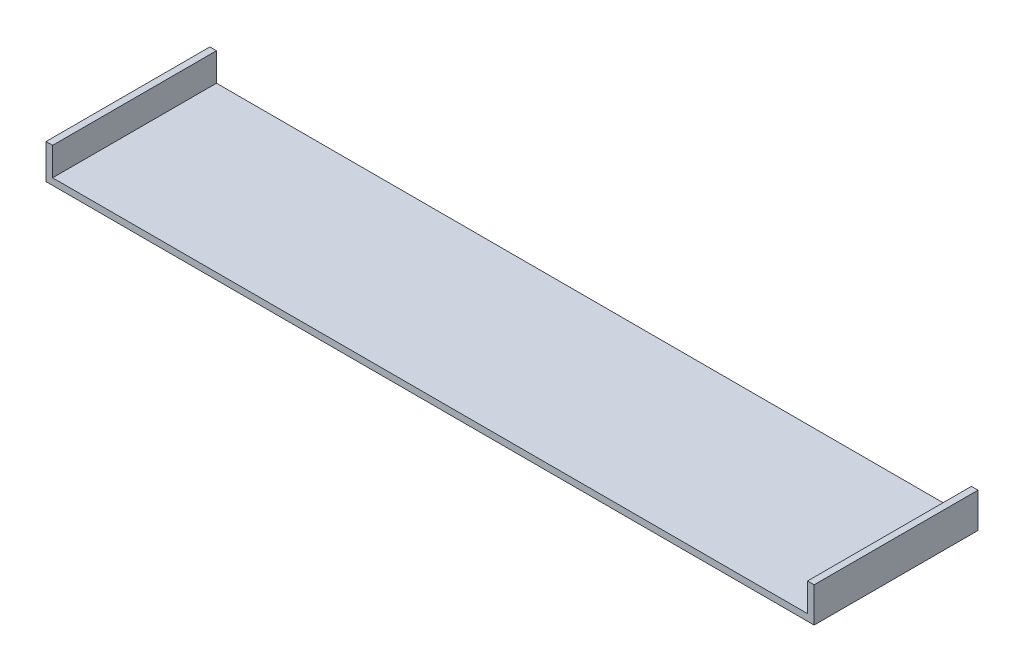
ISO-10303-21;
HEADER;
FILE_DESCRIPTION(('STEP AP214'),'2;1');
FILE_NAME('part.step','',(''),(''),'','','');
FILE_SCHEMA(('AUTOMOTIVE_DESIGN { 1 0 10303 214 1 1 1 1 }'));
ENDSEC;
DATA;
#1=APPLICATION_CONTEXT('core data for automotive mechanical design processes');
#2=APPLICATION_PROTOCOL_DEFINITION('international standard','automotive_design',2000,#1);
#3=PRODUCT_CONTEXT('',#1,'mechanical');
#4=PRODUCT('Part','Part','',(#3));
#5=PRODUCT_RELATED_PRODUCT_CATEGORY('part','',(#4));
#6=PRODUCT_DEFINITION_FORMATION('','',#4);
#7=PRODUCT_DEFINITION_CONTEXT('part definition',#1,'design');
#8=PRODUCT_DEFINITION('design','',#6,#7);
#9=PRODUCT_DEFINITION_SHAPE('','',#8);
#10=(LENGTH_UNIT() NAMED_UNIT(*) SI_UNIT(.MILLI.,.METRE.));
#11=(NAMED_UNIT(*) PLANE_ANGLE_UNIT() SI_UNIT($,.RADIAN.));
#12=(NAMED_UNIT(*) SI_UNIT($,.STERADIAN.) SOLID_ANGLE_UNIT());
#13=UNCERTAINTY_MEASURE_WITH_UNIT(LENGTH_MEASURE(1.E-05),#10,'distance_accuracy_value','');
#14=(GEOMETRIC_REPRESENTATION_CONTEXT(3) GLOBAL_UNCERTAINTY_ASSIGNED_CONTEXT((#13)) GLOBAL_UNIT_ASSIGNED_CONTEXT((#10,
#11,#12)) REPRESENTATION_CONTEXT('',''));
#15=CARTESIAN_POINT('',(0.,0.,0.));
#16=DIRECTION('',(0.,0.,1.));
#17=DIRECTION('',(1.,0.,0.));
#18=AXIS2_PLACEMENT_3D('',#15,#16,#17);
#19=CARTESIAN_POINT('',(446.551474958623,0.,150.));
#20=DIRECTION('',(-1.,0.,0.));
#21=DIRECTION('',(0.,0.,1.));
#22=AXIS2_PLACEMENT_3D('',#19,#20,#21);
#23=PLANE('',#22);
#24=DIRECTION('',(0.,1.,0.));
#25=VECTOR('',#24,1.);
#26=CARTESIAN_POINT('',(446.551474958623,0.,0.));
#27=LINE('',#26,#25);
#28=CARTESIAN_POINT('',(446.551474958623,-6.04818389811423,0.));
#29=VERTEX_POINT('',#28);
#30=CARTESIAN_POINT('',(446.551474958623,25.9156712813162,0.));
#31=VERTEX_POINT('',#30);
#32=EDGE_CURVE('E130',#29,#31,#27,.T.);
#33=ORIENTED_EDGE('',*,*,#32,.T.);
#34=DIRECTION('',(0.,0.,-1.));
#35=VECTOR('',#34,1.);
#36=CARTESIAN_POINT('',(446.551474958623,25.9156712813162,150.));
#37=LINE('',#36,#35);
#38=CARTESIAN_POINT('',(446.551474958623,25.9156712813162,150.));
#39=VERTEX_POINT('',#38);
#40=EDGE_CURVE('E11',#39,#31,#37,.T.);
#41=ORIENTED_EDGE('',*,*,#40,.F.);
#42=DIRECTION('',(0.,1.,0.));
#43=VECTOR('',#42,1.);
#44=CARTESIAN_POINT('',(446.551474958623,0.,150.));
#45=LINE('',#44,#43);
#46=CARTESIAN_POINT('',(446.551474958623,-6.04818389811423,150.));
#47=VERTEX_POINT('',#46);
#48=EDGE_CURVE('E88',#47,#39,#45,.T.);
#49=ORIENTED_EDGE('',*,*,#48,.F.);
#50=DIRECTION('',(0.,0.,-1.));
#51=VECTOR('',#50,1.);
#52=CARTESIAN_POINT('',(446.551474958623,-6.04818389811423,150.));
#53=LINE('',#52,#51);
#54=EDGE_CURVE('E129',#47,#29,#53,.T.);
#55=ORIENTED_EDGE('',*,*,#54,.T.);
#56=EDGE_LOOP('',(#33,#41,#49,#55));
#57=FACE_BOUND('',#56,.T.);
#58=ADVANCED_FACE('F33',(#57),#23,.F.);
#59=CARTESIAN_POINT('',(440.503291060509,25.9156712813162,150.));
#60=DIRECTION('',(0.,1.,0.));
#61=DIRECTION('',(0.,0.,1.));
#62=AXIS2_PLACEMENT_3D('',#59,#60,#61);
#63=PLANE('',#62);
#64=DIRECTION('',(1.,0.,0.));
#65=VECTOR('',#64,1.);
#66=CARTESIAN_POINT('',(440.503291060509,25.9156712813162,0.));
#67=LINE('',#66,#65);
#68=CARTESIAN_POINT('',(440.503291060509,25.9156712813162,0.));
#69=VERTEX_POINT('',#68);
#70=EDGE_CURVE('E133',#69,#31,#67,.T.);
#71=ORIENTED_EDGE('',*,*,#70,.F.);
#72=DIRECTION('',(0.,0.,-1.));
#73=VECTOR('',#72,1.);
#74=CARTESIAN_POINT('',(440.503291060509,25.9156712813162,150.));
#75=LINE('',#74,#73);
#76=CARTESIAN_POINT('',(440.503291060509,25.9156712813162,150.));
#77=VERTEX_POINT('',#76);
#78=EDGE_CURVE('E41',#77,#69,#75,.T.);
#79=ORIENTED_EDGE('',*,*,#78,.F.);
#80=DIRECTION('',(1.,0.,0.));
#81=VECTOR('',#80,1.);
#82=CARTESIAN_POINT('',(440.503291060509,25.9156712813162,150.));
#83=LINE('',#82,#81);
#84=EDGE_CURVE('E172',#77,#39,#83,.T.);
#85=ORIENTED_EDGE('',*,*,#84,.T.);
#86=ORIENTED_EDGE('',*,*,#40,.T.);
#87=EDGE_LOOP('',(#71,#79,#85,#86));
#88=FACE_BOUND('',#87,.T.);
#89=ADVANCED_FACE('F163',(#88),#63,.T.);
#90=CARTESIAN_POINT('',(440.503291060509,0.,150.));
#91=DIRECTION('',(-1.,0.,0.));
#92=DIRECTION('',(0.,0.,1.));
#93=AXIS2_PLACEMENT_3D('',#90,#91,#92);
#94=PLANE('',#93);
#95=DIRECTION('',(0.,1.,0.));
#96=VECTOR('',#95,1.);
#97=CARTESIAN_POINT('',(440.503291060509,0.,0.));
#98=LINE('',#97,#96);
#99=CARTESIAN_POINT('',(440.503291060509,0.,0.));
#100=VERTEX_POINT('',#99);
#101=EDGE_CURVE('E136',#100,#69,#98,.T.);
#102=ORIENTED_EDGE('',*,*,#101,.F.);
#103=DIRECTION('',(0.,0.,-1.));
#104=VECTOR('',#103,1.);
#105=CARTESIAN_POINT('',(440.503291060509,0.,150.));
#106=LINE('',#105,#104);
#107=CARTESIAN_POINT('',(440.503291060509,0.,150.));
#108=VERTEX_POINT('',#107);
#109=EDGE_CURVE('E153',#108,#100,#106,.T.);
#110=ORIENTED_EDGE('',*,*,#109,.F.);
#111=DIRECTION('',(0.,1.,0.));
#112=VECTOR('',#111,1.);
#113=CARTESIAN_POINT('',(440.503291060509,0.,150.));
#114=LINE('',#113,#112);
#115=EDGE_CURVE('E160',#108,#77,#114,.T.);
#116=ORIENTED_EDGE('',*,*,#115,.T.);
#117=ORIENTED_EDGE('',*,*,#78,.T.);
#118=EDGE_LOOP('',(#102,#110,#116,#117));
#119=FACE_BOUND('',#118,.T.);
#120=ADVANCED_FACE('F158',(#119),#94,.T.);
#121=CARTESIAN_POINT('',(-250.514148936986,0.,150.));
#122=DIRECTION('',(0.,1.,0.));
#123=DIRECTION('',(0.,0.,1.));
#124=AXIS2_PLACEMENT_3D('',#121,#122,#123);
#125=PLANE('',#124);
#126=DIRECTION('',(1.,0.,0.));
#127=VECTOR('',#126,1.);
#128=CARTESIAN_POINT('',(-250.514148936986,0.,0.));
#129=LINE('',#128,#127);
#130=CARTESIAN_POINT('',(-250.514148936986,0.,0.));
#131=VERTEX_POINT('',#130);
#132=EDGE_CURVE('E139',#131,#100,#129,.T.);
#133=ORIENTED_EDGE('',*,*,#132,.F.);
#134=DIRECTION('',(0.,0.,-1.));
#135=VECTOR('',#134,1.);
#136=CARTESIAN_POINT('',(-250.514148936986,0.,150.));
#137=LINE('',#136,#135);
#138=CARTESIAN_POINT('',(-250.514148936986,0.,150.));
#139=VERTEX_POINT('',#138);
#140=EDGE_CURVE('E151',#139,#131,#137,.T.);
#141=ORIENTED_EDGE('',*,*,#140,.F.);
#142=DIRECTION('',(1.,0.,0.));
#143=VECTOR('',#142,1.);
#144=CARTESIAN_POINT('',(-250.514148936986,0.,150.));
#145=LINE('',#144,#143);
#146=EDGE_CURVE('E124',#139,#108,#145,.T.);
#147=ORIENTED_EDGE('',*,*,#146,.T.);
#148=ORIENTED_EDGE('',*,*,#109,.T.);
#149=EDGE_LOOP('',(#133,#141,#147,#148));
#150=FACE_BOUND('',#149,.T.);
#151=ADVANCED_FACE('F170',(#150),#125,.T.);
#152=CARTESIAN_POINT('',(-250.514148936986,25.7536347583907,150.));
#153=DIRECTION('',(1.,0.,0.));
#154=DIRECTION('',(0.,0.,-1.));
#155=AXIS2_PLACEMENT_3D('',#152,#153,#154);
#156=PLANE('',#155);
#157=DIRECTION('',(0.,-1.,0.));
#158=VECTOR('',#157,1.);
#159=CARTESIAN_POINT('',(-250.514148936986,25.7536347583907,0.));
#160=LINE('',#159,#158);
#161=CARTESIAN_POINT('',(-250.514148936986,25.7536347583907,0.));
#162=VERTEX_POINT('',#161);
#163=EDGE_CURVE('E142',#162,#131,#160,.T.);
#164=ORIENTED_EDGE('',*,*,#163,.F.);
#165=DIRECTION('',(0.,0.,-1.));
#166=VECTOR('',#165,1.);
#167=CARTESIAN_POINT('',(-250.514148936986,25.7536347583907,150.));
#168=LINE('',#167,#166);
#169=CARTESIAN_POINT('',(-250.514148936986,25.7536347583907,150.));
#170=VERTEX_POINT('',#169);
#171=EDGE_CURVE('E112',#170,#162,#168,.T.);
#172=ORIENTED_EDGE('',*,*,#171,.F.);
#173=DIRECTION('',(0.,-1.,0.));
#174=VECTOR('',#173,1.);
#175=CARTESIAN_POINT('',(-250.514148936986,25.7536347583907,150.));
#176=LINE('',#175,#174);
#177=EDGE_CURVE('E122',#170,#139,#176,.T.);
#178=ORIENTED_EDGE('',*,*,#177,.T.);
#179=ORIENTED_EDGE('',*,*,#140,.T.);
#180=EDGE_LOOP('',(#164,#172,#178,#179));
#181=FACE_BOUND('',#180,.T.);
#182=ADVANCED_FACE('F177',(#181),#156,.T.);
#183=CARTESIAN_POINT('',(-256.5623328351,25.7536347583907,150.));
#184=DIRECTION('',(0.,1.,0.));
#185=DIRECTION('',(0.,0.,1.));
#186=AXIS2_PLACEMENT_3D('',#183,#184,#185);
#187=PLANE('',#186);
#188=DIRECTION('',(1.,0.,0.));
#189=VECTOR('',#188,1.);
#190=CARTESIAN_POINT('',(-256.5623328351,25.7536347583907,0.));
#191=LINE('',#190,#189);
#192=CARTESIAN_POINT('',(-256.5623328351,25.7536347583907,0.));
#193=VERTEX_POINT('',#192);
#194=EDGE_CURVE('E111',#193,#162,#191,.T.);
#195=ORIENTED_EDGE('',*,*,#194,.F.);
#196=DIRECTION('',(0.,0.,-1.));
#197=VECTOR('',#196,1.);
#198=CARTESIAN_POINT('',(-256.5623328351,25.7536347583907,150.));
#199=LINE('',#198,#197);
#200=CARTESIAN_POINT('',(-256.5623328351,25.7536347583907,150.));
#201=VERTEX_POINT('',#200);
#202=EDGE_CURVE('E105',#201,#193,#199,.T.);
#203=ORIENTED_EDGE('',*,*,#202,.F.);
#204=DIRECTION('',(1.,0.,0.));
#205=VECTOR('',#204,1.);
#206=CARTESIAN_POINT('',(-256.5623328351,25.7536347583907,150.));
#207=LINE('',#206,#205);
#208=EDGE_CURVE('E109',#201,#170,#207,.T.);
#209=ORIENTED_EDGE('',*,*,#208,.T.);
#210=ORIENTED_EDGE('',*,*,#171,.T.);
#211=EDGE_LOOP('',(#195,#203,#209,#210));
#212=FACE_BOUND('',#211,.T.);
#213=ADVANCED_FACE('F107',(#212),#187,.T.);
#214=CARTESIAN_POINT('',(-256.5623328351,25.7536347583907,150.));
#215=DIRECTION('',(1.,0.,0.));
#216=DIRECTION('',(0.,0.,-1.));
#217=AXIS2_PLACEMENT_3D('',#214,#215,#216);
#218=PLANE('',#217);
#219=DIRECTION('',(0.,1.,0.));
#220=VECTOR('',#219,1.);
#221=CARTESIAN_POINT('',(-256.5623328351,25.7536347583907,0.));
#222=LINE('',#221,#220);
#223=CARTESIAN_POINT('',(-256.5623328351,-6.04818389811423,0.));
#224=VERTEX_POINT('',#223);
#225=EDGE_CURVE('E76',#193,#224,#222,.F.);
#226=ORIENTED_EDGE('',*,*,#225,.T.);
#227=DIRECTION('',(0.,0.,-1.));
#228=VECTOR('',#227,1.);
#229=CARTESIAN_POINT('',(-256.5623328351,-6.04818389811423,150.));
#230=LINE('',#229,#228);
#231=CARTESIAN_POINT('',(-256.5623328351,-6.04818389811423,150.));
#232=VERTEX_POINT('',#231);
#233=EDGE_CURVE('E113',#232,#224,#230,.T.);
#234=ORIENTED_EDGE('',*,*,#233,.F.);
#235=DIRECTION('',(0.,1.,0.));
#236=VECTOR('',#235,1.);
#237=CARTESIAN_POINT('',(-256.5623328351,25.7536347583907,150.));
#238=LINE('',#237,#236);
#239=EDGE_CURVE('E115',#201,#232,#238,.F.);
#240=ORIENTED_EDGE('',*,*,#239,.F.);
#241=ORIENTED_EDGE('',*,*,#202,.T.);
#242=EDGE_LOOP('',(#226,#234,#240,#241));
#243=FACE_BOUND('',#242,.T.);
#244=ADVANCED_FACE('F116',(#243),#218,.F.);
#245=CARTESIAN_POINT('',(-250.514148936986,-6.04818389811423,150.));
#246=DIRECTION('',(0.,1.,0.));
#247=DIRECTION('',(0.,0.,1.));
#248=AXIS2_PLACEMENT_3D('',#245,#246,#247);
#249=PLANE('',#248);
#250=DIRECTION('',(1.,0.,0.));
#251=VECTOR('',#250,1.);
#252=CARTESIAN_POINT('',(-250.514148936986,-6.04818389811423,0.));
#253=LINE('',#252,#251);
#254=EDGE_CURVE('E82',#224,#29,#253,.T.);
#255=ORIENTED_EDGE('',*,*,#254,.T.);
#256=ORIENTED_EDGE('',*,*,#54,.F.);
#257=DIRECTION('',(1.,0.,0.));
#258=VECTOR('',#257,1.);
#259=CARTESIAN_POINT('',(-250.514148936986,-6.04818389811423,150.));
#260=LINE('',#259,#258);
#261=EDGE_CURVE('E49',#232,#47,#260,.T.);
#262=ORIENTED_EDGE('',*,*,#261,.F.);
#263=ORIENTED_EDGE('',*,*,#233,.T.);
#264=EDGE_LOOP('',(#255,#256,#262,#263));
#265=FACE_BOUND('',#264,.T.);
#266=ADVANCED_FACE('F179',(#265),#249,.F.);
#267=CARTESIAN_POINT('',(0.,0.,150.));
#268=DIRECTION('',(0.,0.,-1.));
#269=DIRECTION('',(-1.,0.,0.));
#270=AXIS2_PLACEMENT_3D('',#267,#268,#269);
#271=PLANE('',#270);
#272=ORIENTED_EDGE('',*,*,#48,.T.);
#273=ORIENTED_EDGE('',*,*,#84,.F.);
#274=ORIENTED_EDGE('',*,*,#115,.F.);
#275=ORIENTED_EDGE('',*,*,#146,.F.);
#276=ORIENTED_EDGE('',*,*,#177,.F.);
#277=ORIENTED_EDGE('',*,*,#208,.F.);
#278=ORIENTED_EDGE('',*,*,#239,.T.);
#279=ORIENTED_EDGE('',*,*,#261,.T.);
#280=EDGE_LOOP('',(#272,#273,#274,#275,#276,#277,#278,#279));
#281=FACE_BOUND('',#280,.T.);
#282=ADVANCED_FACE('F119',(#281),#271,.F.);
#283=CARTESIAN_POINT('',(0.,0.,0.));
#284=DIRECTION('',(0.,0.,-1.));
#285=DIRECTION('',(-1.,0.,0.));
#286=AXIS2_PLACEMENT_3D('',#283,#284,#285);
#287=PLANE('',#286);
#288=ORIENTED_EDGE('',*,*,#32,.F.);
#289=ORIENTED_EDGE('',*,*,#254,.F.);
#290=ORIENTED_EDGE('',*,*,#225,.F.);
#291=ORIENTED_EDGE('',*,*,#194,.T.);
#292=ORIENTED_EDGE('',*,*,#163,.T.);
#293=ORIENTED_EDGE('',*,*,#132,.T.);
#294=ORIENTED_EDGE('',*,*,#101,.T.);
#295=ORIENTED_EDGE('',*,*,#70,.T.);
#296=EDGE_LOOP('',(#288,#289,#290,#291,#292,#293,#294,#295));
#297=FACE_BOUND('',#296,.T.);
#298=ADVANCED_FACE('F166',(#297),#287,.T.);
#299=CLOSED_SHELL('',(#58,#89,#120,#151,#182,#213,#244,#266,#282,#298));
#300=MANIFOLD_SOLID_BREP('B2',#299);
#301=ADVANCED_BREP_SHAPE_REPRESENTATION('',(#18,#300),#14);
#302=SHAPE_DEFINITION_REPRESENTATION(#9,#301);
ENDSEC;
END-ISO-10303-21;
